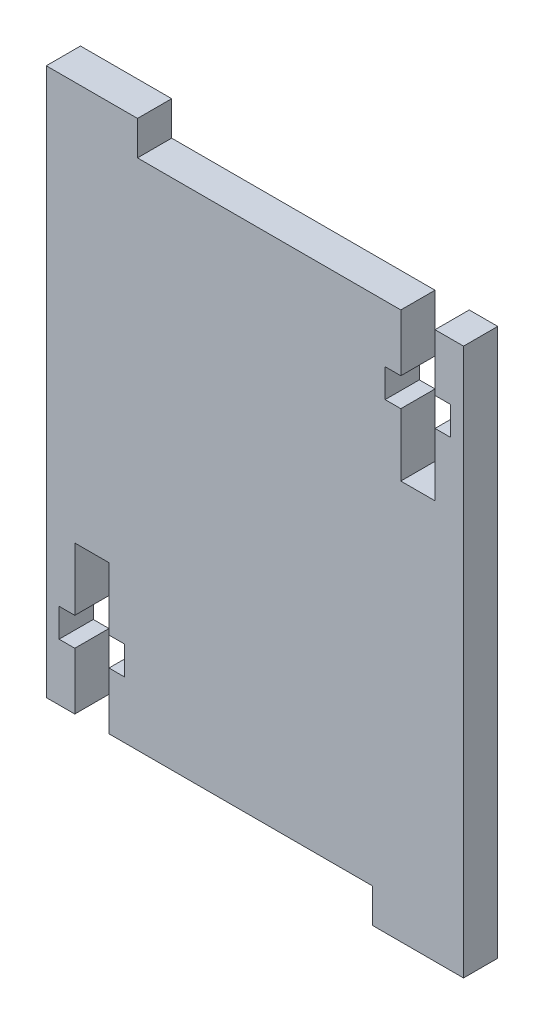
ISO-10303-21;
HEADER;
FILE_DESCRIPTION(('STEP AP214'),'2;1');
FILE_NAME('part.step','',(''),(''),'','','');
FILE_SCHEMA(('AUTOMOTIVE_DESIGN { 1 0 10303 214 1 1 1 1 }'));
ENDSEC;
DATA;
#1=APPLICATION_CONTEXT('core data for automotive mechanical design processes');
#2=APPLICATION_PROTOCOL_DEFINITION('international standard','automotive_design',2000,#1);
#3=PRODUCT_CONTEXT('',#1,'mechanical');
#4=PRODUCT('Part','Part','',(#3));
#5=PRODUCT_RELATED_PRODUCT_CATEGORY('part','',(#4));
#6=PRODUCT_DEFINITION_FORMATION('','',#4);
#7=PRODUCT_DEFINITION_CONTEXT('part definition',#1,'design');
#8=PRODUCT_DEFINITION('design','',#6,#7);
#9=PRODUCT_DEFINITION_SHAPE('','',#8);
#10=(LENGTH_UNIT() NAMED_UNIT(*) SI_UNIT(.MILLI.,.METRE.));
#11=(NAMED_UNIT(*) PLANE_ANGLE_UNIT() SI_UNIT($,.RADIAN.));
#12=(NAMED_UNIT(*) SI_UNIT($,.STERADIAN.) SOLID_ANGLE_UNIT());
#13=UNCERTAINTY_MEASURE_WITH_UNIT(LENGTH_MEASURE(1.E-05),#10,'distance_accuracy_value','');
#14=(GEOMETRIC_REPRESENTATION_CONTEXT(3) GLOBAL_UNCERTAINTY_ASSIGNED_CONTEXT((#13)) GLOBAL_UNIT_ASSIGNED_CONTEXT((#10,
#11,#12)) REPRESENTATION_CONTEXT('',''));
#15=CARTESIAN_POINT('',(0.,0.,0.));
#16=DIRECTION('',(0.,0.,1.));
#17=DIRECTION('',(1.,0.,0.));
#18=AXIS2_PLACEMENT_3D('',#15,#16,#17);
#19=CARTESIAN_POINT('',(5.40983557413339,30.6525398100055,3.));
#20=DIRECTION('',(-1.,0.,0.));
#21=DIRECTION('',(0.,-1.,0.));
#22=AXIS2_PLACEMENT_3D('',#19,#20,#21);
#23=PLANE('',#22);
#24=DIRECTION('',(0.,1.,0.));
#25=VECTOR('',#24,1.);
#26=CARTESIAN_POINT('',(5.40983557413339,30.6525398100055,0.));
#27=LINE('',#26,#25);
#28=CARTESIAN_POINT('',(5.4098355741334,-17.3474601899946,0.));
#29=VERTEX_POINT('',#28);
#30=CARTESIAN_POINT('',(5.40983557413339,30.6525398100055,0.));
#31=VERTEX_POINT('',#30);
#32=EDGE_CURVE('E164',#29,#31,#27,.T.);
#33=ORIENTED_EDGE('',*,*,#32,.T.);
#34=DIRECTION('',(0.,0.,-1.));
#35=VECTOR('',#34,1.);
#36=CARTESIAN_POINT('',(5.40983557413339,30.6525398100055,3.));
#37=LINE('',#36,#35);
#38=CARTESIAN_POINT('',(5.40983557413339,30.6525398100055,3.));
#39=VERTEX_POINT('',#38);
#40=EDGE_CURVE('E11',#39,#31,#37,.T.);
#41=ORIENTED_EDGE('',*,*,#40,.F.);
#42=DIRECTION('',(0.,1.,0.));
#43=VECTOR('',#42,1.);
#44=CARTESIAN_POINT('',(5.4098355741334,-14.3474601899946,3.));
#45=LINE('',#44,#43);
#46=CARTESIAN_POINT('',(5.4098355741334,-17.3474601899946,3.));
#47=VERTEX_POINT('',#46);
#48=EDGE_CURVE('E170',#47,#39,#45,.T.);
#49=ORIENTED_EDGE('',*,*,#48,.F.);
#50=DIRECTION('',(0.,0.,-1.));
#51=VECTOR('',#50,1.);
#52=CARTESIAN_POINT('',(5.4098355741334,-17.3474601899946,3.));
#53=LINE('',#52,#51);
#54=EDGE_CURVE('E280',#47,#29,#53,.T.);
#55=ORIENTED_EDGE('',*,*,#54,.T.);
#56=EDGE_LOOP('',(#33,#41,#49,#55));
#57=FACE_BOUND('',#56,.T.);
#58=ADVANCED_FACE('F39',(#57),#23,.F.);
#59=CARTESIAN_POINT('',(2.90983557413324,30.6525398100055,3.));
#60=DIRECTION('',(0.,-1.,0.));
#61=DIRECTION('',(0.,0.,-1.));
#62=AXIS2_PLACEMENT_3D('',#59,#60,#61);
#63=PLANE('',#62);
#64=DIRECTION('',(-1.,0.,0.));
#65=VECTOR('',#64,1.);
#66=CARTESIAN_POINT('',(2.90983557413324,30.6525398100055,0.));
#67=LINE('',#66,#65);
#68=CARTESIAN_POINT('',(2.90983557413324,30.6525398100055,0.));
#69=VERTEX_POINT('',#68);
#70=EDGE_CURVE('E286',#31,#69,#67,.T.);
#71=ORIENTED_EDGE('',*,*,#70,.T.);
#72=DIRECTION('',(0.,0.,-1.));
#73=VECTOR('',#72,1.);
#74=CARTESIAN_POINT('',(2.90983557413324,30.6525398100055,3.));
#75=LINE('',#74,#73);
#76=CARTESIAN_POINT('',(2.90983557413324,30.6525398100055,3.));
#77=VERTEX_POINT('',#76);
#78=EDGE_CURVE('E48',#77,#69,#75,.T.);
#79=ORIENTED_EDGE('',*,*,#78,.F.);
#80=DIRECTION('',(-1.,0.,0.));
#81=VECTOR('',#80,1.);
#82=CARTESIAN_POINT('',(2.90983557413324,30.6525398100055,3.));
#83=LINE('',#82,#81);
#84=EDGE_CURVE('E603',#39,#77,#83,.T.);
#85=ORIENTED_EDGE('',*,*,#84,.F.);
#86=ORIENTED_EDGE('',*,*,#40,.T.);
#87=EDGE_LOOP('',(#71,#79,#85,#86));
#88=FACE_BOUND('',#87,.T.);
#89=ADVANCED_FACE('F608',(#88),#63,.F.);
#90=CARTESIAN_POINT('',(2.90983557413324,25.6525398100056,3.));
#91=DIRECTION('',(1.,0.,0.));
#92=DIRECTION('',(0.,1.,0.));
#93=AXIS2_PLACEMENT_3D('',#90,#91,#92);
#94=PLANE('',#93);
#95=DIRECTION('',(0.,-1.,0.));
#96=VECTOR('',#95,1.);
#97=CARTESIAN_POINT('',(2.90983557413324,25.6525398100056,0.));
#98=LINE('',#97,#96);
#99=CARTESIAN_POINT('',(2.90983557413324,25.6525398100056,0.));
#100=VERTEX_POINT('',#99);
#101=EDGE_CURVE('E289',#69,#100,#98,.T.);
#102=ORIENTED_EDGE('',*,*,#101,.T.);
#103=DIRECTION('',(0.,0.,-1.));
#104=VECTOR('',#103,1.);
#105=CARTESIAN_POINT('',(2.90983557413324,25.6525398100056,3.));
#106=LINE('',#105,#104);
#107=CARTESIAN_POINT('',(2.90983557413324,25.6525398100056,3.));
#108=VERTEX_POINT('',#107);
#109=EDGE_CURVE('E485',#108,#100,#106,.T.);
#110=ORIENTED_EDGE('',*,*,#109,.F.);
#111=DIRECTION('',(0.,-1.,0.));
#112=VECTOR('',#111,1.);
#113=CARTESIAN_POINT('',(2.90983557413324,25.6525398100056,3.));
#114=LINE('',#113,#112);
#115=EDGE_CURVE('E496',#77,#108,#114,.T.);
#116=ORIENTED_EDGE('',*,*,#115,.F.);
#117=ORIENTED_EDGE('',*,*,#78,.T.);
#118=EDGE_LOOP('',(#102,#110,#116,#117));
#119=FACE_BOUND('',#118,.T.);
#120=ADVANCED_FACE('F494',(#119),#94,.F.);
#121=CARTESIAN_POINT('',(4.28483557413308,25.6525398100056,3.));
#122=DIRECTION('',(0.,1.,0.));
#123=DIRECTION('',(0.,0.,1.));
#124=AXIS2_PLACEMENT_3D('',#121,#122,#123);
#125=PLANE('',#124);
#126=DIRECTION('',(1.,0.,0.));
#127=VECTOR('',#126,1.);
#128=CARTESIAN_POINT('',(4.28483557413308,25.6525398100056,0.));
#129=LINE('',#128,#127);
#130=CARTESIAN_POINT('',(4.28483557413308,25.6525398100056,0.));
#131=VERTEX_POINT('',#130);
#132=EDGE_CURVE('E292',#100,#131,#129,.T.);
#133=ORIENTED_EDGE('',*,*,#132,.T.);
#134=DIRECTION('',(0.,0.,-1.));
#135=VECTOR('',#134,1.);
#136=CARTESIAN_POINT('',(4.28483557413308,25.6525398100056,3.));
#137=LINE('',#136,#135);
#138=CARTESIAN_POINT('',(4.28483557413308,25.6525398100056,3.));
#139=VERTEX_POINT('',#138);
#140=EDGE_CURVE('E481',#139,#131,#137,.T.);
#141=ORIENTED_EDGE('',*,*,#140,.F.);
#142=DIRECTION('',(1.,0.,0.));
#143=VECTOR('',#142,1.);
#144=CARTESIAN_POINT('',(4.28483557413308,25.6525398100056,3.));
#145=LINE('',#144,#143);
#146=EDGE_CURVE('E515',#108,#139,#145,.T.);
#147=ORIENTED_EDGE('',*,*,#146,.F.);
#148=ORIENTED_EDGE('',*,*,#109,.T.);
#149=EDGE_LOOP('',(#133,#141,#147,#148));
#150=FACE_BOUND('',#149,.T.);
#151=ADVANCED_FACE('F505',(#150),#125,.F.);
#152=CARTESIAN_POINT('',(4.28483557413308,23.1525398100053,3.));
#153=DIRECTION('',(1.,0.,0.));
#154=DIRECTION('',(0.,1.,0.));
#155=AXIS2_PLACEMENT_3D('',#152,#153,#154);
#156=PLANE('',#155);
#157=DIRECTION('',(0.,-1.,0.));
#158=VECTOR('',#157,1.);
#159=CARTESIAN_POINT('',(4.28483557413308,23.1525398100053,0.));
#160=LINE('',#159,#158);
#161=CARTESIAN_POINT('',(4.28483557413308,23.1525398100053,0.));
#162=VERTEX_POINT('',#161);
#163=EDGE_CURVE('E295',#131,#162,#160,.T.);
#164=ORIENTED_EDGE('',*,*,#163,.T.);
#165=DIRECTION('',(0.,0.,-1.));
#166=VECTOR('',#165,1.);
#167=CARTESIAN_POINT('',(4.28483557413308,23.1525398100053,3.));
#168=LINE('',#167,#166);
#169=CARTESIAN_POINT('',(4.28483557413308,23.1525398100053,3.));
#170=VERTEX_POINT('',#169);
#171=EDGE_CURVE('E477',#170,#162,#168,.T.);
#172=ORIENTED_EDGE('',*,*,#171,.F.);
#173=DIRECTION('',(0.,-1.,0.));
#174=VECTOR('',#173,1.);
#175=CARTESIAN_POINT('',(4.28483557413308,23.1525398100053,3.));
#176=LINE('',#175,#174);
#177=EDGE_CURVE('E511',#139,#170,#176,.T.);
#178=ORIENTED_EDGE('',*,*,#177,.F.);
#179=ORIENTED_EDGE('',*,*,#140,.T.);
#180=EDGE_LOOP('',(#164,#172,#178,#179));
#181=FACE_BOUND('',#180,.T.);
#182=ADVANCED_FACE('F509',(#181),#156,.F.);
#183=CARTESIAN_POINT('',(2.90983557413303,23.1525398100053,3.));
#184=DIRECTION('',(0.,-1.,0.));
#185=DIRECTION('',(0.,0.,-1.));
#186=AXIS2_PLACEMENT_3D('',#183,#184,#185);
#187=PLANE('',#186);
#188=DIRECTION('',(-1.,0.,0.));
#189=VECTOR('',#188,1.);
#190=CARTESIAN_POINT('',(2.90983557413303,23.1525398100053,0.));
#191=LINE('',#190,#189);
#192=CARTESIAN_POINT('',(2.90983557413303,23.1525398100053,0.));
#193=VERTEX_POINT('',#192);
#194=EDGE_CURVE('E298',#162,#193,#191,.T.);
#195=ORIENTED_EDGE('',*,*,#194,.T.);
#196=DIRECTION('',(0.,0.,-1.));
#197=VECTOR('',#196,1.);
#198=CARTESIAN_POINT('',(2.90983557413303,23.1525398100053,3.));
#199=LINE('',#198,#197);
#200=CARTESIAN_POINT('',(2.90983557413303,23.1525398100053,3.));
#201=VERTEX_POINT('',#200);
#202=EDGE_CURVE('E473',#201,#193,#199,.T.);
#203=ORIENTED_EDGE('',*,*,#202,.F.);
#204=DIRECTION('',(-1.,0.,0.));
#205=VECTOR('',#204,1.);
#206=CARTESIAN_POINT('',(2.90983557413303,23.1525398100053,3.));
#207=LINE('',#206,#205);
#208=EDGE_CURVE('E514',#170,#201,#207,.T.);
#209=ORIENTED_EDGE('',*,*,#208,.F.);
#210=ORIENTED_EDGE('',*,*,#171,.T.);
#211=EDGE_LOOP('',(#195,#203,#209,#210));
#212=FACE_BOUND('',#211,.T.);
#213=ADVANCED_FACE('F620',(#212),#187,.F.);
#214=CARTESIAN_POINT('',(2.90983557413303,17.6525398100054,3.));
#215=DIRECTION('',(1.,0.,0.));
#216=DIRECTION('',(0.,1.,0.));
#217=AXIS2_PLACEMENT_3D('',#214,#215,#216);
#218=PLANE('',#217);
#219=DIRECTION('',(0.,-1.,0.));
#220=VECTOR('',#219,1.);
#221=CARTESIAN_POINT('',(2.90983557413303,17.6525398100054,0.));
#222=LINE('',#221,#220);
#223=CARTESIAN_POINT('',(2.90983557413303,17.6525398100054,0.));
#224=VERTEX_POINT('',#223);
#225=EDGE_CURVE('E301',#193,#224,#222,.T.);
#226=ORIENTED_EDGE('',*,*,#225,.T.);
#227=DIRECTION('',(0.,0.,-1.));
#228=VECTOR('',#227,1.);
#229=CARTESIAN_POINT('',(2.90983557413303,17.6525398100054,3.));
#230=LINE('',#229,#228);
#231=CARTESIAN_POINT('',(2.90983557413303,17.6525398100054,3.));
#232=VERTEX_POINT('',#231);
#233=EDGE_CURVE('E469',#232,#224,#230,.T.);
#234=ORIENTED_EDGE('',*,*,#233,.F.);
#235=DIRECTION('',(0.,-1.,0.));
#236=VECTOR('',#235,1.);
#237=CARTESIAN_POINT('',(2.90983557413303,17.6525398100054,3.));
#238=LINE('',#237,#236);
#239=EDGE_CURVE('E519',#201,#232,#238,.T.);
#240=ORIENTED_EDGE('',*,*,#239,.F.);
#241=ORIENTED_EDGE('',*,*,#202,.T.);
#242=EDGE_LOOP('',(#226,#234,#240,#241));
#243=FACE_BOUND('',#242,.T.);
#244=ADVANCED_FACE('F623',(#243),#218,.F.);
#245=CARTESIAN_POINT('',(-0.0901644258671665,17.6525398100054,3.));
#246=DIRECTION('',(0.,-1.,0.));
#247=DIRECTION('',(0.,0.,-1.));
#248=AXIS2_PLACEMENT_3D('',#245,#246,#247);
#249=PLANE('',#248);
#250=DIRECTION('',(-1.,0.,0.));
#251=VECTOR('',#250,1.);
#252=CARTESIAN_POINT('',(-0.0901644258671665,17.6525398100054,0.));
#253=LINE('',#252,#251);
#254=CARTESIAN_POINT('',(-0.0901644258671665,17.6525398100054,0.));
#255=VERTEX_POINT('',#254);
#256=EDGE_CURVE('E304',#224,#255,#253,.T.);
#257=ORIENTED_EDGE('',*,*,#256,.T.);
#258=DIRECTION('',(0.,0.,-1.));
#259=VECTOR('',#258,1.);
#260=CARTESIAN_POINT('',(-0.0901644258671665,17.6525398100054,3.));
#261=LINE('',#260,#259);
#262=CARTESIAN_POINT('',(-0.0901644258671665,17.6525398100054,3.));
#263=VERTEX_POINT('',#262);
#264=EDGE_CURVE('E465',#263,#255,#261,.T.);
#265=ORIENTED_EDGE('',*,*,#264,.F.);
#266=DIRECTION('',(-1.,0.,0.));
#267=VECTOR('',#266,1.);
#268=CARTESIAN_POINT('',(-0.0901644258671665,17.6525398100054,3.));
#269=LINE('',#268,#267);
#270=EDGE_CURVE('E526',#232,#263,#269,.T.);
#271=ORIENTED_EDGE('',*,*,#270,.F.);
#272=ORIENTED_EDGE('',*,*,#233,.T.);
#273=EDGE_LOOP('',(#257,#265,#271,#272));
#274=FACE_BOUND('',#273,.T.);
#275=ADVANCED_FACE('F627',(#274),#249,.F.);
#276=CARTESIAN_POINT('',(-0.0901644258671671,23.1525398100053,3.));
#277=DIRECTION('',(-1.,0.,0.));
#278=DIRECTION('',(0.,-1.,0.));
#279=AXIS2_PLACEMENT_3D('',#276,#277,#278);
#280=PLANE('',#279);
#281=DIRECTION('',(0.,1.,0.));
#282=VECTOR('',#281,1.);
#283=CARTESIAN_POINT('',(-0.0901644258671671,23.1525398100053,0.));
#284=LINE('',#283,#282);
#285=CARTESIAN_POINT('',(-0.0901644258671671,23.1525398100053,0.));
#286=VERTEX_POINT('',#285);
#287=EDGE_CURVE('E307',#255,#286,#284,.T.);
#288=ORIENTED_EDGE('',*,*,#287,.T.);
#289=DIRECTION('',(0.,0.,-1.));
#290=VECTOR('',#289,1.);
#291=CARTESIAN_POINT('',(-0.0901644258671671,23.1525398100053,3.));
#292=LINE('',#291,#290);
#293=CARTESIAN_POINT('',(-0.0901644258671671,23.1525398100053,3.));
#294=VERTEX_POINT('',#293);
#295=EDGE_CURVE('E461',#294,#286,#292,.T.);
#296=ORIENTED_EDGE('',*,*,#295,.F.);
#297=DIRECTION('',(0.,1.,0.));
#298=VECTOR('',#297,1.);
#299=CARTESIAN_POINT('',(-0.0901644258671671,23.1525398100053,3.));
#300=LINE('',#299,#298);
#301=EDGE_CURVE('E529',#263,#294,#300,.T.);
#302=ORIENTED_EDGE('',*,*,#301,.F.);
#303=ORIENTED_EDGE('',*,*,#264,.T.);
#304=EDGE_LOOP('',(#288,#296,#302,#303));
#305=FACE_BOUND('',#304,.T.);
#306=ADVANCED_FACE('F631',(#305),#280,.F.);
#307=CARTESIAN_POINT('',(-1.46516442586775,23.1525398100053,3.));
#308=DIRECTION('',(0.,-1.,0.));
#309=DIRECTION('',(0.,0.,-1.));
#310=AXIS2_PLACEMENT_3D('',#307,#308,#309);
#311=PLANE('',#310);
#312=DIRECTION('',(-1.,0.,0.));
#313=VECTOR('',#312,1.);
#314=CARTESIAN_POINT('',(-1.46516442586775,23.1525398100053,0.));
#315=LINE('',#314,#313);
#316=CARTESIAN_POINT('',(-1.46516442586775,23.1525398100053,0.));
#317=VERTEX_POINT('',#316);
#318=EDGE_CURVE('E310',#286,#317,#315,.T.);
#319=ORIENTED_EDGE('',*,*,#318,.T.);
#320=DIRECTION('',(0.,0.,-1.));
#321=VECTOR('',#320,1.);
#322=CARTESIAN_POINT('',(-1.46516442586775,23.1525398100053,3.));
#323=LINE('',#322,#321);
#324=CARTESIAN_POINT('',(-1.46516442586775,23.1525398100053,3.));
#325=VERTEX_POINT('',#324);
#326=EDGE_CURVE('E457',#325,#317,#323,.T.);
#327=ORIENTED_EDGE('',*,*,#326,.F.);
#328=DIRECTION('',(-1.,0.,0.));
#329=VECTOR('',#328,1.);
#330=CARTESIAN_POINT('',(-1.46516442586775,23.1525398100053,3.));
#331=LINE('',#330,#329);
#332=EDGE_CURVE('E532',#294,#325,#331,.T.);
#333=ORIENTED_EDGE('',*,*,#332,.F.);
#334=ORIENTED_EDGE('',*,*,#295,.T.);
#335=EDGE_LOOP('',(#319,#327,#333,#334));
#336=FACE_BOUND('',#335,.T.);
#337=ADVANCED_FACE('F635',(#336),#311,.F.);
#338=CARTESIAN_POINT('',(-1.46516442586775,25.6525398100057,3.));
#339=DIRECTION('',(-1.,0.,0.));
#340=DIRECTION('',(0.,-1.,0.));
#341=AXIS2_PLACEMENT_3D('',#338,#339,#340);
#342=PLANE('',#341);
#343=DIRECTION('',(0.,1.,0.));
#344=VECTOR('',#343,1.);
#345=CARTESIAN_POINT('',(-1.46516442586775,25.6525398100057,0.));
#346=LINE('',#345,#344);
#347=CARTESIAN_POINT('',(-1.46516442586775,25.6525398100057,0.));
#348=VERTEX_POINT('',#347);
#349=EDGE_CURVE('E313',#317,#348,#346,.T.);
#350=ORIENTED_EDGE('',*,*,#349,.T.);
#351=DIRECTION('',(0.,0.,-1.));
#352=VECTOR('',#351,1.);
#353=CARTESIAN_POINT('',(-1.46516442586775,25.6525398100057,3.));
#354=LINE('',#353,#352);
#355=CARTESIAN_POINT('',(-1.46516442586775,25.6525398100057,3.));
#356=VERTEX_POINT('',#355);
#357=EDGE_CURVE('E453',#356,#348,#354,.T.);
#358=ORIENTED_EDGE('',*,*,#357,.F.);
#359=DIRECTION('',(0.,1.,0.));
#360=VECTOR('',#359,1.);
#361=CARTESIAN_POINT('',(-1.46516442586775,25.6525398100057,3.));
#362=LINE('',#361,#360);
#363=EDGE_CURVE('E535',#325,#356,#362,.T.);
#364=ORIENTED_EDGE('',*,*,#363,.F.);
#365=ORIENTED_EDGE('',*,*,#326,.T.);
#366=EDGE_LOOP('',(#350,#358,#364,#365));
#367=FACE_BOUND('',#366,.T.);
#368=ADVANCED_FACE('F639',(#367),#342,.F.);
#369=CARTESIAN_POINT('',(-0.0901644258671814,25.6525398100057,3.));
#370=DIRECTION('',(0.,1.,0.));
#371=DIRECTION('',(0.,0.,1.));
#372=AXIS2_PLACEMENT_3D('',#369,#370,#371);
#373=PLANE('',#372);
#374=DIRECTION('',(1.,0.,0.));
#375=VECTOR('',#374,1.);
#376=CARTESIAN_POINT('',(-0.0901644258671814,25.6525398100057,0.));
#377=LINE('',#376,#375);
#378=CARTESIAN_POINT('',(-0.0901644258671814,25.6525398100057,0.));
#379=VERTEX_POINT('',#378);
#380=EDGE_CURVE('E316',#348,#379,#377,.T.);
#381=ORIENTED_EDGE('',*,*,#380,.T.);
#382=DIRECTION('',(0.,0.,-1.));
#383=VECTOR('',#382,1.);
#384=CARTESIAN_POINT('',(-0.0901644258671814,25.6525398100057,3.));
#385=LINE('',#384,#383);
#386=CARTESIAN_POINT('',(-0.0901644258671814,25.6525398100057,3.));
#387=VERTEX_POINT('',#386);
#388=EDGE_CURVE('E449',#387,#379,#385,.T.);
#389=ORIENTED_EDGE('',*,*,#388,.F.);
#390=DIRECTION('',(1.,0.,0.));
#391=VECTOR('',#390,1.);
#392=CARTESIAN_POINT('',(-0.0901644258671814,25.6525398100057,3.));
#393=LINE('',#392,#391);
#394=EDGE_CURVE('E538',#356,#387,#393,.T.);
#395=ORIENTED_EDGE('',*,*,#394,.F.);
#396=ORIENTED_EDGE('',*,*,#357,.T.);
#397=EDGE_LOOP('',(#381,#389,#395,#396));
#398=FACE_BOUND('',#397,.T.);
#399=ADVANCED_FACE('F643',(#398),#373,.F.);
#400=CARTESIAN_POINT('',(-0.090164425867182,30.6525398100054,3.));
#401=DIRECTION('',(-1.,0.,0.));
#402=DIRECTION('',(0.,-1.,0.));
#403=AXIS2_PLACEMENT_3D('',#400,#401,#402);
#404=PLANE('',#403);
#405=DIRECTION('',(0.,1.,0.));
#406=VECTOR('',#405,1.);
#407=CARTESIAN_POINT('',(-0.090164425867182,30.6525398100054,0.));
#408=LINE('',#407,#406);
#409=CARTESIAN_POINT('',(-0.090164425867182,30.6525398100054,0.));
#410=VERTEX_POINT('',#409);
#411=EDGE_CURVE('E319',#379,#410,#408,.T.);
#412=ORIENTED_EDGE('',*,*,#411,.T.);
#413=DIRECTION('',(0.,0.,-1.));
#414=VECTOR('',#413,1.);
#415=CARTESIAN_POINT('',(-0.090164425867182,30.6525398100054,3.));
#416=LINE('',#415,#414);
#417=CARTESIAN_POINT('',(-0.090164425867182,30.6525398100054,3.));
#418=VERTEX_POINT('',#417);
#419=EDGE_CURVE('E445',#418,#410,#416,.T.);
#420=ORIENTED_EDGE('',*,*,#419,.F.);
#421=DIRECTION('',(0.,1.,0.));
#422=VECTOR('',#421,1.);
#423=CARTESIAN_POINT('',(-0.090164425867182,30.6525398100054,3.));
#424=LINE('',#423,#422);
#425=EDGE_CURVE('E541',#387,#418,#424,.T.);
#426=ORIENTED_EDGE('',*,*,#425,.F.);
#427=ORIENTED_EDGE('',*,*,#388,.T.);
#428=EDGE_LOOP('',(#412,#420,#426,#427));
#429=FACE_BOUND('',#428,.T.);
#430=ADVANCED_FACE('F647',(#429),#404,.F.);
#431=CARTESIAN_POINT('',(-0.090164425867182,30.6525398100054,3.));
#432=DIRECTION('',(0.,-1.,0.));
#433=DIRECTION('',(1.,0.,0.));
#434=AXIS2_PLACEMENT_3D('',#431,#432,#433);
#435=PLANE('',#434);
#436=DIRECTION('',(-1.,0.,0.));
#437=VECTOR('',#436,1.);
#438=CARTESIAN_POINT('',(-0.090164425867182,30.6525398100054,0.));
#439=LINE('',#438,#437);
#440=CARTESIAN_POINT('',(-23.190164425867,30.6525398100053,0.));
#441=VERTEX_POINT('',#440);
#442=EDGE_CURVE('E322',#410,#441,#439,.T.);
#443=ORIENTED_EDGE('',*,*,#442,.T.);
#444=DIRECTION('',(0.,0.,-1.));
#445=VECTOR('',#444,1.);
#446=CARTESIAN_POINT('',(-23.190164425867,30.6525398100053,3.));
#447=LINE('',#446,#445);
#448=CARTESIAN_POINT('',(-23.190164425867,30.6525398100053,3.));
#449=VERTEX_POINT('',#448);
#450=EDGE_CURVE('E441',#449,#441,#447,.T.);
#451=ORIENTED_EDGE('',*,*,#450,.F.);
#452=DIRECTION('',(-1.,0.,0.));
#453=VECTOR('',#452,1.);
#454=CARTESIAN_POINT('',(-0.090164425867182,30.6525398100054,3.));
#455=LINE('',#454,#453);
#456=EDGE_CURVE('E544',#418,#449,#455,.T.);
#457=ORIENTED_EDGE('',*,*,#456,.F.);
#458=ORIENTED_EDGE('',*,*,#419,.T.);
#459=EDGE_LOOP('',(#443,#451,#457,#458));
#460=FACE_BOUND('',#459,.T.);
#461=ADVANCED_FACE('F651',(#460),#435,.F.);
#462=CARTESIAN_POINT('',(-23.1901644258669,33.6525398100051,3.));
#463=DIRECTION('',(-1.,0.,0.));
#464=DIRECTION('',(0.,-1.,0.));
#465=AXIS2_PLACEMENT_3D('',#462,#463,#464);
#466=PLANE('',#465);
#467=DIRECTION('',(0.,1.,0.));
#468=VECTOR('',#467,1.);
#469=CARTESIAN_POINT('',(-23.1901644258669,33.6525398100051,0.));
#470=LINE('',#469,#468);
#471=CARTESIAN_POINT('',(-23.1901644258669,33.6525398100051,0.));
#472=VERTEX_POINT('',#471);
#473=EDGE_CURVE('E325',#441,#472,#470,.T.);
#474=ORIENTED_EDGE('',*,*,#473,.T.);
#475=DIRECTION('',(0.,0.,-1.));
#476=VECTOR('',#475,1.);
#477=CARTESIAN_POINT('',(-23.1901644258669,33.6525398100051,3.));
#478=LINE('',#477,#476);
#479=CARTESIAN_POINT('',(-23.1901644258669,33.6525398100051,3.));
#480=VERTEX_POINT('',#479);
#481=EDGE_CURVE('E437',#480,#472,#478,.T.);
#482=ORIENTED_EDGE('',*,*,#481,.F.);
#483=DIRECTION('',(0.,1.,0.));
#484=VECTOR('',#483,1.);
#485=CARTESIAN_POINT('',(-23.1901644258669,33.6525398100051,3.));
#486=LINE('',#485,#484);
#487=EDGE_CURVE('E547',#449,#480,#486,.T.);
#488=ORIENTED_EDGE('',*,*,#487,.F.);
#489=ORIENTED_EDGE('',*,*,#450,.T.);
#490=EDGE_LOOP('',(#474,#482,#488,#489));
#491=FACE_BOUND('',#490,.T.);
#492=ADVANCED_FACE('F655',(#491),#466,.F.);
#493=CARTESIAN_POINT('',(-31.1901644258669,33.6525398100053,3.));
#494=DIRECTION('',(0.,-1.,0.));
#495=DIRECTION('',(1.,0.,0.));
#496=AXIS2_PLACEMENT_3D('',#493,#494,#495);
#497=PLANE('',#496);
#498=DIRECTION('',(-1.,0.,0.));
#499=VECTOR('',#498,1.);
#500=CARTESIAN_POINT('',(-31.1901644258669,33.6525398100053,0.));
#501=LINE('',#500,#499);
#502=CARTESIAN_POINT('',(-31.1901644258669,33.6525398100053,0.));
#503=VERTEX_POINT('',#502);
#504=EDGE_CURVE('E328',#472,#503,#501,.T.);
#505=ORIENTED_EDGE('',*,*,#504,.T.);
#506=DIRECTION('',(0.,0.,-1.));
#507=VECTOR('',#506,1.);
#508=CARTESIAN_POINT('',(-31.1901644258669,33.6525398100053,3.));
#509=LINE('',#508,#507);
#510=CARTESIAN_POINT('',(-31.1901644258669,33.6525398100053,3.));
#511=VERTEX_POINT('',#510);
#512=EDGE_CURVE('E433',#511,#503,#509,.T.);
#513=ORIENTED_EDGE('',*,*,#512,.F.);
#514=DIRECTION('',(-1.,0.,0.));
#515=VECTOR('',#514,1.);
#516=CARTESIAN_POINT('',(-31.1901644258669,33.6525398100053,3.));
#517=LINE('',#516,#515);
#518=EDGE_CURVE('E550',#480,#511,#517,.T.);
#519=ORIENTED_EDGE('',*,*,#518,.F.);
#520=ORIENTED_EDGE('',*,*,#481,.T.);
#521=EDGE_LOOP('',(#505,#513,#519,#520));
#522=FACE_BOUND('',#521,.T.);
#523=ADVANCED_FACE('F659',(#522),#497,.F.);
#524=CARTESIAN_POINT('',(-31.190164425867,30.6525398100054,3.));
#525=DIRECTION('',(1.,0.,0.));
#526=DIRECTION('',(0.,1.,0.));
#527=AXIS2_PLACEMENT_3D('',#524,#525,#526);
#528=PLANE('',#527);
#529=DIRECTION('',(0.,-1.,0.));
#530=VECTOR('',#529,1.);
#531=CARTESIAN_POINT('',(-31.190164425867,30.6525398100054,0.));
#532=LINE('',#531,#530);
#533=CARTESIAN_POINT('',(-31.190164425867,-14.3474601899946,0.));
#534=VERTEX_POINT('',#533);
#535=EDGE_CURVE('E332',#503,#534,#532,.T.);
#536=ORIENTED_EDGE('',*,*,#535,.T.);
#537=DIRECTION('',(0.,0.,-1.));
#538=VECTOR('',#537,1.);
#539=CARTESIAN_POINT('',(-31.190164425867,-14.3474601899946,3.));
#540=LINE('',#539,#538);
#541=CARTESIAN_POINT('',(-31.190164425867,-14.3474601899946,3.));
#542=VERTEX_POINT('',#541);
#543=EDGE_CURVE('E429',#542,#534,#540,.T.);
#544=ORIENTED_EDGE('',*,*,#543,.F.);
#545=DIRECTION('',(0.,-1.,0.));
#546=VECTOR('',#545,1.);
#547=CARTESIAN_POINT('',(-31.190164425867,30.6525398100054,3.));
#548=LINE('',#547,#546);
#549=EDGE_CURVE('E553',#511,#542,#548,.T.);
#550=ORIENTED_EDGE('',*,*,#549,.F.);
#551=ORIENTED_EDGE('',*,*,#512,.T.);
#552=EDGE_LOOP('',(#536,#544,#550,#551));
#553=FACE_BOUND('',#552,.T.);
#554=ADVANCED_FACE('F663',(#553),#528,.F.);
#555=CARTESIAN_POINT('',(-31.190164425867,-14.3474601899946,3.));
#556=DIRECTION('',(0.,1.,0.));
#557=DIRECTION('',(0.,0.,1.));
#558=AXIS2_PLACEMENT_3D('',#555,#556,#557);
#559=PLANE('',#558);
#560=DIRECTION('',(1.,0.,0.));
#561=VECTOR('',#560,1.);
#562=CARTESIAN_POINT('',(-31.190164425867,-14.3474601899946,0.));
#563=LINE('',#562,#561);
#564=CARTESIAN_POINT('',(-28.690164425867,-14.3474601899946,0.));
#565=VERTEX_POINT('',#564);
#566=EDGE_CURVE('E335',#534,#565,#563,.T.);
#567=ORIENTED_EDGE('',*,*,#566,.T.);
#568=DIRECTION('',(0.,0.,-1.));
#569=VECTOR('',#568,1.);
#570=CARTESIAN_POINT('',(-28.690164425867,-14.3474601899946,3.));
#571=LINE('',#570,#569);
#572=CARTESIAN_POINT('',(-28.690164425867,-14.3474601899946,3.));
#573=VERTEX_POINT('',#572);
#574=EDGE_CURVE('E425',#573,#565,#571,.T.);
#575=ORIENTED_EDGE('',*,*,#574,.F.);
#576=DIRECTION('',(1.,0.,0.));
#577=VECTOR('',#576,1.);
#578=CARTESIAN_POINT('',(-31.190164425867,-14.3474601899946,3.));
#579=LINE('',#578,#577);
#580=EDGE_CURVE('E556',#542,#573,#579,.T.);
#581=ORIENTED_EDGE('',*,*,#580,.F.);
#582=ORIENTED_EDGE('',*,*,#543,.T.);
#583=EDGE_LOOP('',(#567,#575,#581,#582));
#584=FACE_BOUND('',#583,.T.);
#585=ADVANCED_FACE('F667',(#584),#559,.F.);
#586=CARTESIAN_POINT('',(-28.690164425867,-9.34746018999497,3.));
#587=DIRECTION('',(-1.,0.,0.));
#588=DIRECTION('',(0.,-1.,0.));
#589=AXIS2_PLACEMENT_3D('',#586,#587,#588);
#590=PLANE('',#589);
#591=DIRECTION('',(0.,1.,0.));
#592=VECTOR('',#591,1.);
#593=CARTESIAN_POINT('',(-28.690164425867,-9.34746018999497,0.));
#594=LINE('',#593,#592);
#595=CARTESIAN_POINT('',(-28.690164425867,-9.34746018999497,0.));
#596=VERTEX_POINT('',#595);
#597=EDGE_CURVE('E338',#565,#596,#594,.T.);
#598=ORIENTED_EDGE('',*,*,#597,.T.);
#599=DIRECTION('',(0.,0.,-1.));
#600=VECTOR('',#599,1.);
#601=CARTESIAN_POINT('',(-28.690164425867,-9.34746018999497,3.));
#602=LINE('',#601,#600);
#603=CARTESIAN_POINT('',(-28.690164425867,-9.34746018999497,3.));
#604=VERTEX_POINT('',#603);
#605=EDGE_CURVE('E421',#604,#596,#602,.T.);
#606=ORIENTED_EDGE('',*,*,#605,.F.);
#607=DIRECTION('',(0.,1.,0.));
#608=VECTOR('',#607,1.);
#609=CARTESIAN_POINT('',(-28.690164425867,-9.34746018999497,3.));
#610=LINE('',#609,#608);
#611=EDGE_CURVE('E559',#573,#604,#610,.T.);
#612=ORIENTED_EDGE('',*,*,#611,.F.);
#613=ORIENTED_EDGE('',*,*,#574,.T.);
#614=EDGE_LOOP('',(#598,#606,#612,#613));
#615=FACE_BOUND('',#614,.T.);
#616=ADVANCED_FACE('F671',(#615),#590,.F.);
#617=CARTESIAN_POINT('',(-30.0651644258669,-9.34746018999499,3.));
#618=DIRECTION('',(0.,-1.,0.));
#619=DIRECTION('',(1.,0.,0.));
#620=AXIS2_PLACEMENT_3D('',#617,#618,#619);
#621=PLANE('',#620);
#622=DIRECTION('',(-1.,0.,0.));
#623=VECTOR('',#622,1.);
#624=CARTESIAN_POINT('',(-30.0651644258669,-9.34746018999499,0.));
#625=LINE('',#624,#623);
#626=CARTESIAN_POINT('',(-30.0651644258669,-9.34746018999499,0.));
#627=VERTEX_POINT('',#626);
#628=EDGE_CURVE('E341',#596,#627,#625,.T.);
#629=ORIENTED_EDGE('',*,*,#628,.T.);
#630=DIRECTION('',(0.,0.,-1.));
#631=VECTOR('',#630,1.);
#632=CARTESIAN_POINT('',(-30.0651644258669,-9.34746018999499,3.));
#633=LINE('',#632,#631);
#634=CARTESIAN_POINT('',(-30.0651644258669,-9.34746018999499,3.));
#635=VERTEX_POINT('',#634);
#636=EDGE_CURVE('E417',#635,#627,#633,.T.);
#637=ORIENTED_EDGE('',*,*,#636,.F.);
#638=DIRECTION('',(-1.,0.,0.));
#639=VECTOR('',#638,1.);
#640=CARTESIAN_POINT('',(-30.0651644258669,-9.34746018999499,3.));
#641=LINE('',#640,#639);
#642=EDGE_CURVE('E562',#604,#635,#641,.T.);
#643=ORIENTED_EDGE('',*,*,#642,.F.);
#644=ORIENTED_EDGE('',*,*,#605,.T.);
#645=EDGE_LOOP('',(#629,#637,#643,#644));
#646=FACE_BOUND('',#645,.T.);
#647=ADVANCED_FACE('F675',(#646),#621,.F.);
#648=CARTESIAN_POINT('',(-30.0651644258669,-6.84746018999457,3.));
#649=DIRECTION('',(-1.,0.,0.));
#650=DIRECTION('',(0.,-1.,0.));
#651=AXIS2_PLACEMENT_3D('',#648,#649,#650);
#652=PLANE('',#651);
#653=DIRECTION('',(0.,1.,0.));
#654=VECTOR('',#653,1.);
#655=CARTESIAN_POINT('',(-30.0651644258669,-6.84746018999457,0.));
#656=LINE('',#655,#654);
#657=CARTESIAN_POINT('',(-30.0651644258669,-6.84746018999457,0.));
#658=VERTEX_POINT('',#657);
#659=EDGE_CURVE('E344',#627,#658,#656,.T.);
#660=ORIENTED_EDGE('',*,*,#659,.T.);
#661=DIRECTION('',(0.,0.,-1.));
#662=VECTOR('',#661,1.);
#663=CARTESIAN_POINT('',(-30.0651644258669,-6.84746018999457,3.));
#664=LINE('',#663,#662);
#665=CARTESIAN_POINT('',(-30.0651644258669,-6.84746018999457,3.));
#666=VERTEX_POINT('',#665);
#667=EDGE_CURVE('E413',#666,#658,#664,.T.);
#668=ORIENTED_EDGE('',*,*,#667,.F.);
#669=DIRECTION('',(0.,1.,0.));
#670=VECTOR('',#669,1.);
#671=CARTESIAN_POINT('',(-30.0651644258669,-6.84746018999457,3.));
#672=LINE('',#671,#670);
#673=EDGE_CURVE('E565',#635,#666,#672,.T.);
#674=ORIENTED_EDGE('',*,*,#673,.F.);
#675=ORIENTED_EDGE('',*,*,#636,.T.);
#676=EDGE_LOOP('',(#660,#668,#674,#675));
#677=FACE_BOUND('',#676,.T.);
#678=ADVANCED_FACE('F679',(#677),#652,.F.);
#679=CARTESIAN_POINT('',(-28.690164425867,-6.84746018999456,3.));
#680=DIRECTION('',(0.,1.,0.));
#681=DIRECTION('',(-1.,0.,0.));
#682=AXIS2_PLACEMENT_3D('',#679,#680,#681);
#683=PLANE('',#682);
#684=DIRECTION('',(1.,0.,0.));
#685=VECTOR('',#684,1.);
#686=CARTESIAN_POINT('',(-28.690164425867,-6.84746018999456,0.));
#687=LINE('',#686,#685);
#688=CARTESIAN_POINT('',(-28.690164425867,-6.84746018999456,0.));
#689=VERTEX_POINT('',#688);
#690=EDGE_CURVE('E347',#658,#689,#687,.T.);
#691=ORIENTED_EDGE('',*,*,#690,.T.);
#692=DIRECTION('',(0.,0.,-1.));
#693=VECTOR('',#692,1.);
#694=CARTESIAN_POINT('',(-28.690164425867,-6.84746018999456,3.));
#695=LINE('',#694,#693);
#696=CARTESIAN_POINT('',(-28.690164425867,-6.84746018999456,3.));
#697=VERTEX_POINT('',#696);
#698=EDGE_CURVE('E409',#697,#689,#695,.T.);
#699=ORIENTED_EDGE('',*,*,#698,.F.);
#700=DIRECTION('',(1.,0.,0.));
#701=VECTOR('',#700,1.);
#702=CARTESIAN_POINT('',(-28.690164425867,-6.84746018999456,3.));
#703=LINE('',#702,#701);
#704=EDGE_CURVE('E568',#666,#697,#703,.T.);
#705=ORIENTED_EDGE('',*,*,#704,.F.);
#706=ORIENTED_EDGE('',*,*,#667,.T.);
#707=EDGE_LOOP('',(#691,#699,#705,#706));
#708=FACE_BOUND('',#707,.T.);
#709=ADVANCED_FACE('F683',(#708),#683,.F.);
#710=CARTESIAN_POINT('',(-28.6901644258671,-1.34746018999457,3.));
#711=DIRECTION('',(-1.,0.,0.));
#712=DIRECTION('',(0.,-1.,0.));
#713=AXIS2_PLACEMENT_3D('',#710,#711,#712);
#714=PLANE('',#713);
#715=DIRECTION('',(0.,1.,0.));
#716=VECTOR('',#715,1.);
#717=CARTESIAN_POINT('',(-28.6901644258671,-1.34746018999457,0.));
#718=LINE('',#717,#716);
#719=CARTESIAN_POINT('',(-28.6901644258671,-1.34746018999457,0.));
#720=VERTEX_POINT('',#719);
#721=EDGE_CURVE('E350',#689,#720,#718,.T.);
#722=ORIENTED_EDGE('',*,*,#721,.T.);
#723=DIRECTION('',(0.,0.,-1.));
#724=VECTOR('',#723,1.);
#725=CARTESIAN_POINT('',(-28.6901644258671,-1.34746018999457,3.));
#726=LINE('',#725,#724);
#727=CARTESIAN_POINT('',(-28.6901644258671,-1.34746018999457,3.));
#728=VERTEX_POINT('',#727);
#729=EDGE_CURVE('E405',#728,#720,#726,.T.);
#730=ORIENTED_EDGE('',*,*,#729,.F.);
#731=DIRECTION('',(0.,1.,0.));
#732=VECTOR('',#731,1.);
#733=CARTESIAN_POINT('',(-28.6901644258671,-1.34746018999457,3.));
#734=LINE('',#733,#732);
#735=EDGE_CURVE('E571',#697,#728,#734,.T.);
#736=ORIENTED_EDGE('',*,*,#735,.F.);
#737=ORIENTED_EDGE('',*,*,#698,.T.);
#738=EDGE_LOOP('',(#722,#730,#736,#737));
#739=FACE_BOUND('',#738,.T.);
#740=ADVANCED_FACE('F687',(#739),#714,.F.);
#741=CARTESIAN_POINT('',(-25.6901644258667,-1.34746018999455,3.));
#742=DIRECTION('',(0.,1.,0.));
#743=DIRECTION('',(-1.,0.,0.));
#744=AXIS2_PLACEMENT_3D('',#741,#742,#743);
#745=PLANE('',#744);
#746=DIRECTION('',(1.,0.,0.));
#747=VECTOR('',#746,1.);
#748=CARTESIAN_POINT('',(-25.6901644258667,-1.34746018999455,0.));
#749=LINE('',#748,#747);
#750=CARTESIAN_POINT('',(-25.6901644258667,-1.34746018999455,0.));
#751=VERTEX_POINT('',#750);
#752=EDGE_CURVE('E353',#720,#751,#749,.T.);
#753=ORIENTED_EDGE('',*,*,#752,.T.);
#754=DIRECTION('',(0.,0.,-1.));
#755=VECTOR('',#754,1.);
#756=CARTESIAN_POINT('',(-25.6901644258667,-1.34746018999455,3.));
#757=LINE('',#756,#755);
#758=CARTESIAN_POINT('',(-25.6901644258667,-1.34746018999455,3.));
#759=VERTEX_POINT('',#758);
#760=EDGE_CURVE('E401',#759,#751,#757,.T.);
#761=ORIENTED_EDGE('',*,*,#760,.F.);
#762=DIRECTION('',(1.,0.,0.));
#763=VECTOR('',#762,1.);
#764=CARTESIAN_POINT('',(-25.6901644258667,-1.34746018999455,3.));
#765=LINE('',#764,#763);
#766=EDGE_CURVE('E574',#728,#759,#765,.T.);
#767=ORIENTED_EDGE('',*,*,#766,.F.);
#768=ORIENTED_EDGE('',*,*,#729,.T.);
#769=EDGE_LOOP('',(#753,#761,#767,#768));
#770=FACE_BOUND('',#769,.T.);
#771=ADVANCED_FACE('F691',(#770),#745,.F.);
#772=CARTESIAN_POINT('',(-25.6901644258666,-6.84746018999454,3.));
#773=DIRECTION('',(1.,0.,0.));
#774=DIRECTION('',(0.,1.,0.));
#775=AXIS2_PLACEMENT_3D('',#772,#773,#774);
#776=PLANE('',#775);
#777=DIRECTION('',(0.,-1.,0.));
#778=VECTOR('',#777,1.);
#779=CARTESIAN_POINT('',(-25.6901644258666,-6.84746018999454,0.));
#780=LINE('',#779,#778);
#781=CARTESIAN_POINT('',(-25.6901644258666,-6.84746018999454,0.));
#782=VERTEX_POINT('',#781);
#783=EDGE_CURVE('E356',#751,#782,#780,.T.);
#784=ORIENTED_EDGE('',*,*,#783,.T.);
#785=DIRECTION('',(0.,0.,-1.));
#786=VECTOR('',#785,1.);
#787=CARTESIAN_POINT('',(-25.6901644258666,-6.84746018999454,3.));
#788=LINE('',#787,#786);
#789=CARTESIAN_POINT('',(-25.6901644258666,-6.84746018999454,3.));
#790=VERTEX_POINT('',#789);
#791=EDGE_CURVE('E397',#790,#782,#788,.T.);
#792=ORIENTED_EDGE('',*,*,#791,.F.);
#793=DIRECTION('',(0.,-1.,0.));
#794=VECTOR('',#793,1.);
#795=CARTESIAN_POINT('',(-25.6901644258666,-6.84746018999454,3.));
#796=LINE('',#795,#794);
#797=EDGE_CURVE('E577',#759,#790,#796,.T.);
#798=ORIENTED_EDGE('',*,*,#797,.F.);
#799=ORIENTED_EDGE('',*,*,#760,.T.);
#800=EDGE_LOOP('',(#784,#792,#798,#799));
#801=FACE_BOUND('',#800,.T.);
#802=ADVANCED_FACE('F695',(#801),#776,.F.);
#803=CARTESIAN_POINT('',(-24.315164425866,-6.84746018999454,3.));
#804=DIRECTION('',(0.,1.,0.));
#805=DIRECTION('',(-1.,0.,0.));
#806=AXIS2_PLACEMENT_3D('',#803,#804,#805);
#807=PLANE('',#806);
#808=DIRECTION('',(1.,0.,0.));
#809=VECTOR('',#808,1.);
#810=CARTESIAN_POINT('',(-24.315164425866,-6.84746018999454,0.));
#811=LINE('',#810,#809);
#812=CARTESIAN_POINT('',(-24.315164425866,-6.84746018999454,0.));
#813=VERTEX_POINT('',#812);
#814=EDGE_CURVE('E359',#782,#813,#811,.T.);
#815=ORIENTED_EDGE('',*,*,#814,.T.);
#816=DIRECTION('',(0.,0.,-1.));
#817=VECTOR('',#816,1.);
#818=CARTESIAN_POINT('',(-24.315164425866,-6.84746018999454,3.));
#819=LINE('',#818,#817);
#820=CARTESIAN_POINT('',(-24.315164425866,-6.84746018999454,3.));
#821=VERTEX_POINT('',#820);
#822=EDGE_CURVE('E393',#821,#813,#819,.T.);
#823=ORIENTED_EDGE('',*,*,#822,.F.);
#824=DIRECTION('',(1.,0.,0.));
#825=VECTOR('',#824,1.);
#826=CARTESIAN_POINT('',(-24.315164425866,-6.84746018999454,3.));
#827=LINE('',#826,#825);
#828=EDGE_CURVE('E580',#790,#821,#827,.T.);
#829=ORIENTED_EDGE('',*,*,#828,.F.);
#830=ORIENTED_EDGE('',*,*,#791,.T.);
#831=EDGE_LOOP('',(#815,#823,#829,#830));
#832=FACE_BOUND('',#831,.T.);
#833=ADVANCED_FACE('F699',(#832),#807,.F.);
#834=CARTESIAN_POINT('',(-24.315164425866,-9.34746018999493,3.));
#835=DIRECTION('',(1.,0.,0.));
#836=DIRECTION('',(0.,1.,0.));
#837=AXIS2_PLACEMENT_3D('',#834,#835,#836);
#838=PLANE('',#837);
#839=DIRECTION('',(0.,-1.,0.));
#840=VECTOR('',#839,1.);
#841=CARTESIAN_POINT('',(-24.315164425866,-9.34746018999493,0.));
#842=LINE('',#841,#840);
#843=CARTESIAN_POINT('',(-24.315164425866,-9.34746018999493,0.));
#844=VERTEX_POINT('',#843);
#845=EDGE_CURVE('E362',#813,#844,#842,.T.);
#846=ORIENTED_EDGE('',*,*,#845,.T.);
#847=DIRECTION('',(0.,0.,-1.));
#848=VECTOR('',#847,1.);
#849=CARTESIAN_POINT('',(-24.315164425866,-9.34746018999493,3.));
#850=LINE('',#849,#848);
#851=CARTESIAN_POINT('',(-24.315164425866,-9.34746018999493,3.));
#852=VERTEX_POINT('',#851);
#853=EDGE_CURVE('E389',#852,#844,#850,.T.);
#854=ORIENTED_EDGE('',*,*,#853,.F.);
#855=DIRECTION('',(0.,-1.,0.));
#856=VECTOR('',#855,1.);
#857=CARTESIAN_POINT('',(-24.315164425866,-9.34746018999493,3.));
#858=LINE('',#857,#856);
#859=EDGE_CURVE('E583',#821,#852,#858,.T.);
#860=ORIENTED_EDGE('',*,*,#859,.F.);
#861=ORIENTED_EDGE('',*,*,#822,.T.);
#862=EDGE_LOOP('',(#846,#854,#860,#861));
#863=FACE_BOUND('',#862,.T.);
#864=ADVANCED_FACE('F703',(#863),#838,.F.);
#865=CARTESIAN_POINT('',(-25.6901644258666,-9.34746018999494,3.));
#866=DIRECTION('',(0.,-1.,0.));
#867=DIRECTION('',(1.,0.,0.));
#868=AXIS2_PLACEMENT_3D('',#865,#866,#867);
#869=PLANE('',#868);
#870=DIRECTION('',(-1.,0.,0.));
#871=VECTOR('',#870,1.);
#872=CARTESIAN_POINT('',(-25.6901644258666,-9.34746018999494,0.));
#873=LINE('',#872,#871);
#874=CARTESIAN_POINT('',(-25.6901644258666,-9.34746018999494,0.));
#875=VERTEX_POINT('',#874);
#876=EDGE_CURVE('E365',#844,#875,#873,.T.);
#877=ORIENTED_EDGE('',*,*,#876,.T.);
#878=DIRECTION('',(0.,0.,-1.));
#879=VECTOR('',#878,1.);
#880=CARTESIAN_POINT('',(-25.6901644258666,-9.34746018999494,3.));
#881=LINE('',#880,#879);
#882=CARTESIAN_POINT('',(-25.6901644258666,-9.34746018999494,3.));
#883=VERTEX_POINT('',#882);
#884=EDGE_CURVE('E385',#883,#875,#881,.T.);
#885=ORIENTED_EDGE('',*,*,#884,.F.);
#886=DIRECTION('',(-1.,0.,0.));
#887=VECTOR('',#886,1.);
#888=CARTESIAN_POINT('',(-25.6901644258666,-9.34746018999494,3.));
#889=LINE('',#888,#887);
#890=EDGE_CURVE('E586',#852,#883,#889,.T.);
#891=ORIENTED_EDGE('',*,*,#890,.F.);
#892=ORIENTED_EDGE('',*,*,#853,.T.);
#893=EDGE_LOOP('',(#877,#885,#891,#892));
#894=FACE_BOUND('',#893,.T.);
#895=ADVANCED_FACE('F594',(#894),#869,.F.);
#896=CARTESIAN_POINT('',(-25.6901644258666,-14.3474601899946,3.));
#897=DIRECTION('',(1.,0.,0.));
#898=DIRECTION('',(0.,1.,0.));
#899=AXIS2_PLACEMENT_3D('',#896,#897,#898);
#900=PLANE('',#899);
#901=DIRECTION('',(0.,-1.,0.));
#902=VECTOR('',#901,1.);
#903=CARTESIAN_POINT('',(-25.6901644258666,-14.3474601899946,0.));
#904=LINE('',#903,#902);
#905=CARTESIAN_POINT('',(-25.6901644258666,-14.3474601899946,0.));
#906=VERTEX_POINT('',#905);
#907=EDGE_CURVE('E368',#875,#906,#904,.T.);
#908=ORIENTED_EDGE('',*,*,#907,.T.);
#909=DIRECTION('',(0.,0.,-1.));
#910=VECTOR('',#909,1.);
#911=CARTESIAN_POINT('',(-25.6901644258666,-14.3474601899946,3.));
#912=LINE('',#911,#910);
#913=CARTESIAN_POINT('',(-25.6901644258666,-14.3474601899946,3.));
#914=VERTEX_POINT('',#913);
#915=EDGE_CURVE('E273',#914,#906,#912,.T.);
#916=ORIENTED_EDGE('',*,*,#915,.F.);
#917=DIRECTION('',(0.,-1.,0.));
#918=VECTOR('',#917,1.);
#919=CARTESIAN_POINT('',(-25.6901644258666,-14.3474601899946,3.));
#920=LINE('',#919,#918);
#921=EDGE_CURVE('E262',#883,#914,#920,.T.);
#922=ORIENTED_EDGE('',*,*,#921,.F.);
#923=ORIENTED_EDGE('',*,*,#884,.T.);
#924=EDGE_LOOP('',(#908,#916,#922,#923));
#925=FACE_BOUND('',#924,.T.);
#926=ADVANCED_FACE('F598',(#925),#900,.F.);
#927=CARTESIAN_POINT('',(-2.5901644258666,-14.3474601899946,3.));
#928=DIRECTION('',(0.,1.,0.));
#929=DIRECTION('',(0.,0.,1.));
#930=AXIS2_PLACEMENT_3D('',#927,#928,#929);
#931=PLANE('',#930);
#932=DIRECTION('',(1.,0.,0.));
#933=VECTOR('',#932,1.);
#934=CARTESIAN_POINT('',(-2.5901644258666,-14.3474601899946,0.));
#935=LINE('',#934,#933);
#936=CARTESIAN_POINT('',(-2.5901644258666,-14.3474601899946,0.));
#937=VERTEX_POINT('',#936);
#938=EDGE_CURVE('E271',#906,#937,#935,.T.);
#939=ORIENTED_EDGE('',*,*,#938,.T.);
#940=DIRECTION('',(0.,0.,-1.));
#941=VECTOR('',#940,1.);
#942=CARTESIAN_POINT('',(-2.5901644258666,-14.3474601899946,3.));
#943=LINE('',#942,#941);
#944=CARTESIAN_POINT('',(-2.5901644258666,-14.3474601899946,3.));
#945=VERTEX_POINT('',#944);
#946=EDGE_CURVE('E268',#945,#937,#943,.T.);
#947=ORIENTED_EDGE('',*,*,#946,.F.);
#948=DIRECTION('',(1.,0.,0.));
#949=VECTOR('',#948,1.);
#950=CARTESIAN_POINT('',(-2.5901644258666,-14.3474601899946,3.));
#951=LINE('',#950,#949);
#952=EDGE_CURVE('E256',#914,#945,#951,.T.);
#953=ORIENTED_EDGE('',*,*,#952,.F.);
#954=ORIENTED_EDGE('',*,*,#915,.T.);
#955=EDGE_LOOP('',(#939,#947,#953,#954));
#956=FACE_BOUND('',#955,.T.);
#957=ADVANCED_FACE('F269',(#956),#931,.F.);
#958=CARTESIAN_POINT('',(-2.5901644258666,-17.3474601899946,3.));
#959=DIRECTION('',(1.,0.,0.));
#960=DIRECTION('',(0.,0.,-1.));
#961=AXIS2_PLACEMENT_3D('',#958,#959,#960);
#962=PLANE('',#961);
#963=DIRECTION('',(0.,-1.,0.));
#964=VECTOR('',#963,1.);
#965=CARTESIAN_POINT('',(-2.5901644258666,-17.3474601899946,0.));
#966=LINE('',#965,#964);
#967=CARTESIAN_POINT('',(-2.5901644258666,-17.3474601899946,0.));
#968=VERTEX_POINT('',#967);
#969=EDGE_CURVE('E157',#937,#968,#966,.T.);
#970=ORIENTED_EDGE('',*,*,#969,.T.);
#971=DIRECTION('',(0.,0.,-1.));
#972=VECTOR('',#971,1.);
#973=CARTESIAN_POINT('',(-2.5901644258666,-17.3474601899946,3.));
#974=LINE('',#973,#972);
#975=CARTESIAN_POINT('',(-2.5901644258666,-17.3474601899946,3.));
#976=VERTEX_POINT('',#975);
#977=EDGE_CURVE('E274',#976,#968,#974,.T.);
#978=ORIENTED_EDGE('',*,*,#977,.F.);
#979=DIRECTION('',(0.,-1.,0.));
#980=VECTOR('',#979,1.);
#981=CARTESIAN_POINT('',(-2.5901644258666,-17.3474601899946,3.));
#982=LINE('',#981,#980);
#983=EDGE_CURVE('E260',#945,#976,#982,.T.);
#984=ORIENTED_EDGE('',*,*,#983,.F.);
#985=ORIENTED_EDGE('',*,*,#946,.T.);
#986=EDGE_LOOP('',(#970,#978,#984,#985));
#987=FACE_BOUND('',#986,.T.);
#988=ADVANCED_FACE('F276',(#987),#962,.F.);
#989=CARTESIAN_POINT('',(5.4098355741334,-17.3474601899946,3.));
#990=DIRECTION('',(0.,1.,0.));
#991=DIRECTION('',(0.,0.,1.));
#992=AXIS2_PLACEMENT_3D('',#989,#990,#991);
#993=PLANE('',#992);
#994=DIRECTION('',(1.,0.,0.));
#995=VECTOR('',#994,1.);
#996=CARTESIAN_POINT('',(5.4098355741334,-17.3474601899946,0.));
#997=LINE('',#996,#995);
#998=EDGE_CURVE('E375',#968,#29,#997,.T.);
#999=ORIENTED_EDGE('',*,*,#998,.T.);
#1000=ORIENTED_EDGE('',*,*,#54,.F.);
#1001=DIRECTION('',(1.,0.,0.));
#1002=VECTOR('',#1001,1.);
#1003=CARTESIAN_POINT('',(5.4098355741334,-17.3474601899946,3.));
#1004=LINE('',#1003,#1002);
#1005=EDGE_CURVE('E56',#976,#47,#1004,.T.);
#1006=ORIENTED_EDGE('',*,*,#1005,.F.);
#1007=ORIENTED_EDGE('',*,*,#977,.T.);
#1008=EDGE_LOOP('',(#999,#1000,#1006,#1007));
#1009=FACE_BOUND('',#1008,.T.);
#1010=ADVANCED_FACE('F600',(#1009),#993,.F.);
#1011=CARTESIAN_POINT('',(0.,0.,3.));
#1012=DIRECTION('',(0.,0.,-1.));
#1013=DIRECTION('',(-1.,0.,0.));
#1014=AXIS2_PLACEMENT_3D('',#1011,#1012,#1013);
#1015=PLANE('',#1014);
#1016=ORIENTED_EDGE('',*,*,#48,.T.);
#1017=ORIENTED_EDGE('',*,*,#84,.T.);
#1018=ORIENTED_EDGE('',*,*,#115,.T.);
#1019=ORIENTED_EDGE('',*,*,#146,.T.);
#1020=ORIENTED_EDGE('',*,*,#177,.T.);
#1021=ORIENTED_EDGE('',*,*,#208,.T.);
#1022=ORIENTED_EDGE('',*,*,#239,.T.);
#1023=ORIENTED_EDGE('',*,*,#270,.T.);
#1024=ORIENTED_EDGE('',*,*,#301,.T.);
#1025=ORIENTED_EDGE('',*,*,#332,.T.);
#1026=ORIENTED_EDGE('',*,*,#363,.T.);
#1027=ORIENTED_EDGE('',*,*,#394,.T.);
#1028=ORIENTED_EDGE('',*,*,#425,.T.);
#1029=ORIENTED_EDGE('',*,*,#456,.T.);
#1030=ORIENTED_EDGE('',*,*,#487,.T.);
#1031=ORIENTED_EDGE('',*,*,#518,.T.);
#1032=ORIENTED_EDGE('',*,*,#549,.T.);
#1033=ORIENTED_EDGE('',*,*,#580,.T.);
#1034=ORIENTED_EDGE('',*,*,#611,.T.);
#1035=ORIENTED_EDGE('',*,*,#642,.T.);
#1036=ORIENTED_EDGE('',*,*,#673,.T.);
#1037=ORIENTED_EDGE('',*,*,#704,.T.);
#1038=ORIENTED_EDGE('',*,*,#735,.T.);
#1039=ORIENTED_EDGE('',*,*,#766,.T.);
#1040=ORIENTED_EDGE('',*,*,#797,.T.);
#1041=ORIENTED_EDGE('',*,*,#828,.T.);
#1042=ORIENTED_EDGE('',*,*,#859,.T.);
#1043=ORIENTED_EDGE('',*,*,#890,.T.);
#1044=ORIENTED_EDGE('',*,*,#921,.T.);
#1045=ORIENTED_EDGE('',*,*,#952,.T.);
#1046=ORIENTED_EDGE('',*,*,#983,.T.);
#1047=ORIENTED_EDGE('',*,*,#1005,.T.);
#1048=EDGE_LOOP('',(#1016,#1017,#1018,#1019,#1020,#1021,#1022,#1023,#1024,#1025,#1026,#1027,
#1028,#1029,#1030,#1031,#1032,#1033,#1034,#1035,#1036,#1037,#1038,#1039,#1040,#1041,#1042,#1043,
#1044,#1045,#1046,#1047));
#1049=FACE_BOUND('',#1048,.T.);
#1050=ADVANCED_FACE('F258',(#1049),#1015,.F.);
#1051=CARTESIAN_POINT('',(0.,0.,0.));
#1052=DIRECTION('',(0.,0.,-1.));
#1053=DIRECTION('',(-1.,0.,0.));
#1054=AXIS2_PLACEMENT_3D('',#1051,#1052,#1053);
#1055=PLANE('',#1054);
#1056=ORIENTED_EDGE('',*,*,#32,.F.);
#1057=ORIENTED_EDGE('',*,*,#998,.F.);
#1058=ORIENTED_EDGE('',*,*,#969,.F.);
#1059=ORIENTED_EDGE('',*,*,#938,.F.);
#1060=ORIENTED_EDGE('',*,*,#907,.F.);
#1061=ORIENTED_EDGE('',*,*,#876,.F.);
#1062=ORIENTED_EDGE('',*,*,#845,.F.);
#1063=ORIENTED_EDGE('',*,*,#814,.F.);
#1064=ORIENTED_EDGE('',*,*,#783,.F.);
#1065=ORIENTED_EDGE('',*,*,#752,.F.);
#1066=ORIENTED_EDGE('',*,*,#721,.F.);
#1067=ORIENTED_EDGE('',*,*,#690,.F.);
#1068=ORIENTED_EDGE('',*,*,#659,.F.);
#1069=ORIENTED_EDGE('',*,*,#628,.F.);
#1070=ORIENTED_EDGE('',*,*,#597,.F.);
#1071=ORIENTED_EDGE('',*,*,#566,.F.);
#1072=ORIENTED_EDGE('',*,*,#535,.F.);
#1073=ORIENTED_EDGE('',*,*,#504,.F.);
#1074=ORIENTED_EDGE('',*,*,#473,.F.);
#1075=ORIENTED_EDGE('',*,*,#442,.F.);
#1076=ORIENTED_EDGE('',*,*,#411,.F.);
#1077=ORIENTED_EDGE('',*,*,#380,.F.);
#1078=ORIENTED_EDGE('',*,*,#349,.F.);
#1079=ORIENTED_EDGE('',*,*,#318,.F.);
#1080=ORIENTED_EDGE('',*,*,#287,.F.);
#1081=ORIENTED_EDGE('',*,*,#256,.F.);
#1082=ORIENTED_EDGE('',*,*,#225,.F.);
#1083=ORIENTED_EDGE('',*,*,#194,.F.);
#1084=ORIENTED_EDGE('',*,*,#163,.F.);
#1085=ORIENTED_EDGE('',*,*,#132,.F.);
#1086=ORIENTED_EDGE('',*,*,#101,.F.);
#1087=ORIENTED_EDGE('',*,*,#70,.F.);
#1088=EDGE_LOOP('',(#1056,#1057,#1058,#1059,#1060,#1061,#1062,#1063,#1064,#1065,#1066,#1067,
#1068,#1069,#1070,#1071,#1072,#1073,#1074,#1075,#1076,#1077,#1078,#1079,#1080,#1081,#1082,#1083,
#1084,#1085,#1086,#1087));
#1089=FACE_BOUND('',#1088,.T.);
#1090=ADVANCED_FACE('F500',(#1089),#1055,.T.);
#1091=CLOSED_SHELL('',(#58,#89,#120,#151,#182,#213,#244,#275,#306,#337,#368,#399,#430,#461,#492,
#523,#554,#585,#616,#647,#678,#709,#740,#771,#802,#833,#864,#895,#926,#957,#988,#1010,#1050,#1090));
#1092=MANIFOLD_SOLID_BREP('B2',#1091);
#1093=ADVANCED_BREP_SHAPE_REPRESENTATION('',(#18,#1092),#14);
#1094=SHAPE_DEFINITION_REPRESENTATION(#9,#1093);
ENDSEC;
END-ISO-10303-21;
